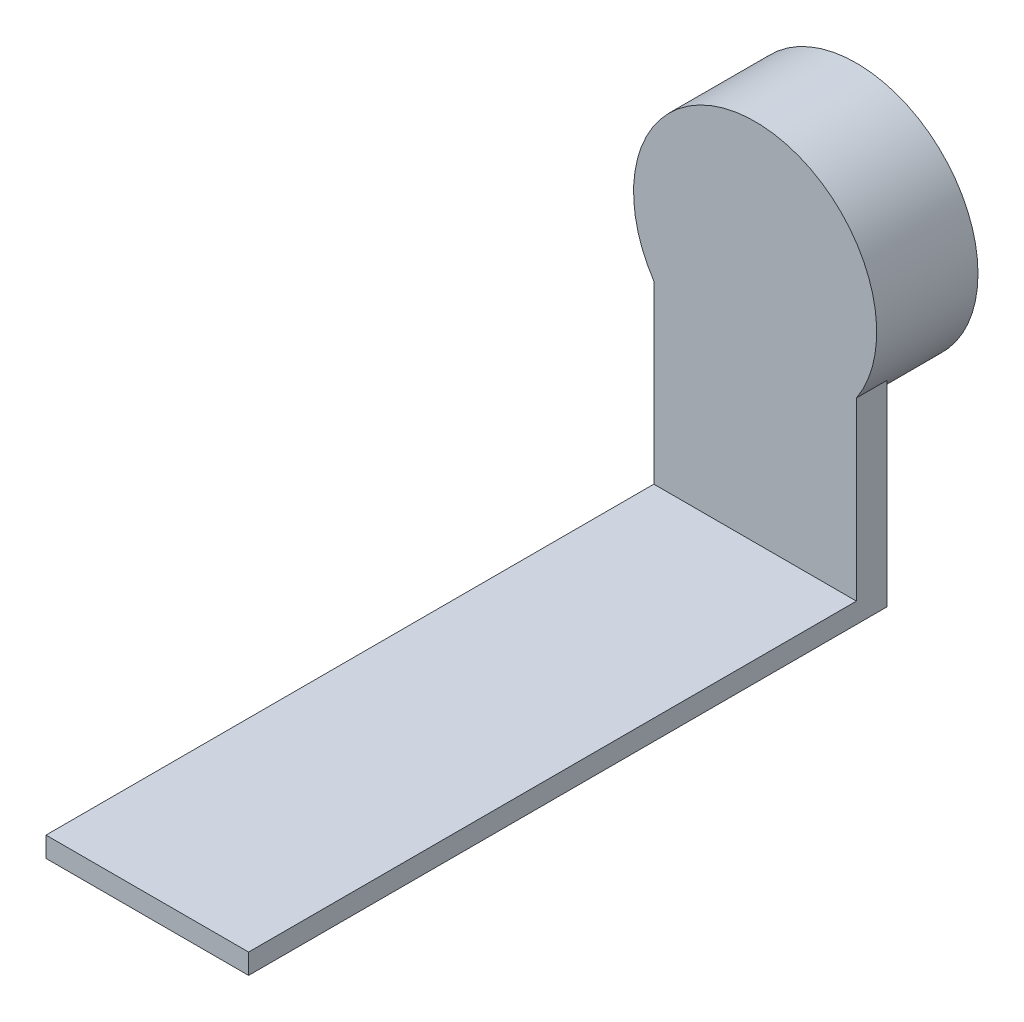
ISO-10303-21;
HEADER;
FILE_DESCRIPTION(('STEP AP214'),'2;1');
FILE_NAME('part.step','',(''),(''),'','','');
FILE_SCHEMA(('AUTOMOTIVE_DESIGN { 1 0 10303 214 1 1 1 1 }'));
ENDSEC;
DATA;
#1=APPLICATION_CONTEXT('core data for automotive mechanical design processes');
#2=APPLICATION_PROTOCOL_DEFINITION('international standard','automotive_design',2000,#1);
#3=PRODUCT_CONTEXT('',#1,'mechanical');
#4=PRODUCT('Part','Part','',(#3));
#5=PRODUCT_RELATED_PRODUCT_CATEGORY('part','',(#4));
#6=PRODUCT_DEFINITION_FORMATION('','',#4);
#7=PRODUCT_DEFINITION_CONTEXT('part definition',#1,'design');
#8=PRODUCT_DEFINITION('design','',#6,#7);
#9=PRODUCT_DEFINITION_SHAPE('','',#8);
#10=(LENGTH_UNIT() NAMED_UNIT(*) SI_UNIT(.MILLI.,.METRE.));
#11=(NAMED_UNIT(*) PLANE_ANGLE_UNIT() SI_UNIT($,.RADIAN.));
#12=(NAMED_UNIT(*) SI_UNIT($,.STERADIAN.) SOLID_ANGLE_UNIT());
#13=UNCERTAINTY_MEASURE_WITH_UNIT(LENGTH_MEASURE(1.E-05),#10,'distance_accuracy_value','');
#14=(GEOMETRIC_REPRESENTATION_CONTEXT(3) GLOBAL_UNCERTAINTY_ASSIGNED_CONTEXT((#13)) GLOBAL_UNIT_ASSIGNED_CONTEXT((#10,
#11,#12)) REPRESENTATION_CONTEXT('',''));
#15=CARTESIAN_POINT('',(0.,0.,0.));
#16=DIRECTION('',(0.,0.,1.));
#17=DIRECTION('',(1.,0.,0.));
#18=AXIS2_PLACEMENT_3D('',#15,#16,#17);
#19=CARTESIAN_POINT('',(0.,0.,10.));
#20=DIRECTION('',(0.,0.,-1.));
#21=DIRECTION('',(-1.,0.,0.));
#22=AXIS2_PLACEMENT_3D('',#19,#20,#21);
#23=CYLINDRICAL_SURFACE('',#22,12.);
#24=CARTESIAN_POINT('',(0.,0.,7.));
#25=DIRECTION('',(0.,0.,-1.));
#26=DIRECTION('',(1.,0.,0.));
#27=AXIS2_PLACEMENT_3D('',#24,#25,#26);
#28=CIRCLE('',#27,12.);
#29=CARTESIAN_POINT('',(10.,-6.6332495807108,7.));
#30=VERTEX_POINT('',#29);
#31=CARTESIAN_POINT('',(-10.,-6.6332495807108,7.));
#32=VERTEX_POINT('',#31);
#33=EDGE_CURVE('E136',#30,#32,#28,.T.);
#34=ORIENTED_EDGE('',*,*,#33,.T.);
#35=DIRECTION('',(0.,0.,1.));
#36=VECTOR('',#35,1.);
#37=CARTESIAN_POINT('',(-10.,-6.6332495807108,7.));
#38=LINE('',#37,#36);
#39=CARTESIAN_POINT('',(-10.,-6.6332495807108,10.));
#40=VERTEX_POINT('',#39);
#41=EDGE_CURVE('E102',#32,#40,#38,.T.);
#42=ORIENTED_EDGE('',*,*,#41,.T.);
#43=CARTESIAN_POINT('',(0.,0.,10.));
#44=DIRECTION('',(0.,0.,1.));
#45=DIRECTION('',(1.,0.,0.));
#46=AXIS2_PLACEMENT_3D('',#43,#44,#45);
#47=CIRCLE('',#46,12.);
#48=CARTESIAN_POINT('',(10.,-6.6332495807108,10.));
#49=VERTEX_POINT('',#48);
#50=EDGE_CURVE('E11',#49,#40,#47,.T.);
#51=ORIENTED_EDGE('',*,*,#50,.F.);
#52=DIRECTION('',(0.,0.,1.));
#53=VECTOR('',#52,1.);
#54=CARTESIAN_POINT('',(10.,-6.6332495807108,7.));
#55=LINE('',#54,#53);
#56=EDGE_CURVE('E144',#30,#49,#55,.T.);
#57=ORIENTED_EDGE('',*,*,#56,.F.);
#58=EDGE_LOOP('',(#34,#42,#51,#57));
#59=FACE_BOUND('',#58,.T.);
#60=CARTESIAN_POINT('',(0.,0.,0.));
#61=DIRECTION('',(0.,0.,1.));
#62=DIRECTION('',(1.,0.,0.));
#63=AXIS2_PLACEMENT_3D('',#60,#61,#62);
#64=CIRCLE('',#63,12.);
#65=CARTESIAN_POINT('',(12.,0.,0.));
#66=VERTEX_POINT('',#65);
#67=EDGE_CURVE('E44',#66,#66,#64,.T.);
#68=ORIENTED_EDGE('',*,*,#67,.T.);
#69=EDGE_LOOP('',(#68));
#70=FACE_BOUND('',#69,.T.);
#71=ADVANCED_FACE('F41',(#59,#70),#23,.T.);
#72=CARTESIAN_POINT('',(0.,0.,10.));
#73=DIRECTION('',(0.,0.,1.));
#74=DIRECTION('',(1.,0.,0.));
#75=AXIS2_PLACEMENT_3D('',#72,#73,#74);
#76=PLANE('',#75);
#77=DIRECTION('',(-1.,0.,0.));
#78=VECTOR('',#77,1.);
#79=CARTESIAN_POINT('',(-10.,-24.,10.));
#80=LINE('',#79,#78);
#81=CARTESIAN_POINT('',(10.,-24.,10.));
#82=VERTEX_POINT('',#81);
#83=CARTESIAN_POINT('',(-10.,-24.,10.));
#84=VERTEX_POINT('',#83);
#85=EDGE_CURVE('E55',#82,#84,#80,.T.);
#86=ORIENTED_EDGE('',*,*,#85,.F.);
#87=DIRECTION('',(0.,1.,0.));
#88=VECTOR('',#87,1.);
#89=CARTESIAN_POINT('',(10.,-26.,10.));
#90=LINE('',#89,#88);
#91=EDGE_CURVE('E58',#82,#49,#90,.T.);
#92=ORIENTED_EDGE('',*,*,#91,.T.);
#93=ORIENTED_EDGE('',*,*,#50,.T.);
#94=DIRECTION('',(0.,-1.,0.));
#95=VECTOR('',#94,1.);
#96=CARTESIAN_POINT('',(-10.,-26.,10.));
#97=LINE('',#96,#95);
#98=EDGE_CURVE('E133',#40,#84,#97,.T.);
#99=ORIENTED_EDGE('',*,*,#98,.T.);
#100=EDGE_LOOP('',(#86,#92,#93,#99));
#101=FACE_BOUND('',#100,.T.);
#102=ADVANCED_FACE('F154',(#101),#76,.T.);
#103=CARTESIAN_POINT('',(0.,0.,0.));
#104=DIRECTION('',(0.,0.,1.));
#105=DIRECTION('',(1.,0.,0.));
#106=AXIS2_PLACEMENT_3D('',#103,#104,#105);
#107=PLANE('',#106);
#108=CARTESIAN_POINT('',(0.,0.,0.));
#109=DIRECTION('',(0.,0.,-1.));
#110=DIRECTION('',(-1.,0.,0.));
#111=AXIS2_PLACEMENT_3D('',#108,#109,#110);
#112=CIRCLE('',#111,10.);
#113=CARTESIAN_POINT('',(-10.,0.,0.));
#114=VERTEX_POINT('',#113);
#115=EDGE_CURVE('E120',#114,#114,#112,.T.);
#116=ORIENTED_EDGE('',*,*,#115,.F.);
#117=EDGE_LOOP('',(#116));
#118=FACE_BOUND('',#117,.T.);
#119=ORIENTED_EDGE('',*,*,#67,.F.);
#120=EDGE_LOOP('',(#119));
#121=FACE_BOUND('',#120,.T.);
#122=ADVANCED_FACE('F172',(#118,#121),#107,.F.);
#123=CARTESIAN_POINT('',(10.,-26.,7.));
#124=DIRECTION('',(0.,-1.,0.));
#125=DIRECTION('',(1.,0.,0.));
#126=AXIS2_PLACEMENT_3D('',#123,#124,#125);
#127=PLANE('',#126);
#128=DIRECTION('',(0.,0.,1.));
#129=VECTOR('',#128,1.);
#130=CARTESIAN_POINT('',(10.,-26.,7.));
#131=LINE('',#130,#129);
#132=CARTESIAN_POINT('',(10.,-26.,7.));
#133=VERTEX_POINT('',#132);
#134=CARTESIAN_POINT('',(10.,-26.,70.));
#135=VERTEX_POINT('',#134);
#136=EDGE_CURVE('E107',#133,#135,#131,.T.);
#137=ORIENTED_EDGE('',*,*,#136,.T.);
#138=DIRECTION('',(1.,0.,0.));
#139=VECTOR('',#138,1.);
#140=CARTESIAN_POINT('',(-10.,-26.,70.));
#141=LINE('',#140,#139);
#142=CARTESIAN_POINT('',(-10.,-26.,70.));
#143=VERTEX_POINT('',#142);
#144=EDGE_CURVE('E105',#143,#135,#141,.T.);
#145=ORIENTED_EDGE('',*,*,#144,.F.);
#146=DIRECTION('',(0.,0.,1.));
#147=VECTOR('',#146,1.);
#148=CARTESIAN_POINT('',(-10.,-26.,7.));
#149=LINE('',#148,#147);
#150=CARTESIAN_POINT('',(-10.,-26.,7.));
#151=VERTEX_POINT('',#150);
#152=EDGE_CURVE('E91',#151,#143,#149,.T.);
#153=ORIENTED_EDGE('',*,*,#152,.F.);
#154=DIRECTION('',(1.,0.,0.));
#155=VECTOR('',#154,1.);
#156=CARTESIAN_POINT('',(10.,-26.,7.));
#157=LINE('',#156,#155);
#158=EDGE_CURVE('E130',#151,#133,#157,.T.);
#159=ORIENTED_EDGE('',*,*,#158,.T.);
#160=EDGE_LOOP('',(#137,#145,#153,#159));
#161=FACE_BOUND('',#160,.T.);
#162=ADVANCED_FACE('F106',(#161),#127,.T.);
#163=CARTESIAN_POINT('',(-10.,-26.,7.));
#164=DIRECTION('',(-1.,0.,0.));
#165=DIRECTION('',(0.,-1.,0.));
#166=AXIS2_PLACEMENT_3D('',#163,#164,#165);
#167=PLANE('',#166);
#168=ORIENTED_EDGE('',*,*,#98,.F.);
#169=ORIENTED_EDGE('',*,*,#41,.F.);
#170=DIRECTION('',(0.,-1.,0.));
#171=VECTOR('',#170,1.);
#172=CARTESIAN_POINT('',(-10.,-26.,7.));
#173=LINE('',#172,#171);
#174=EDGE_CURVE('E98',#32,#151,#173,.T.);
#175=ORIENTED_EDGE('',*,*,#174,.T.);
#176=ORIENTED_EDGE('',*,*,#152,.T.);
#177=DIRECTION('',(0.,-1.,0.));
#178=VECTOR('',#177,1.);
#179=CARTESIAN_POINT('',(-10.,-26.,70.));
#180=LINE('',#179,#178);
#181=CARTESIAN_POINT('',(-10.,-24.,70.));
#182=VERTEX_POINT('',#181);
#183=EDGE_CURVE('E96',#182,#143,#180,.T.);
#184=ORIENTED_EDGE('',*,*,#183,.F.);
#185=DIRECTION('',(0.,0.,-1.));
#186=VECTOR('',#185,1.);
#187=CARTESIAN_POINT('',(-10.,-24.,70.));
#188=LINE('',#187,#186);
#189=EDGE_CURVE('E124',#182,#84,#188,.T.);
#190=ORIENTED_EDGE('',*,*,#189,.T.);
#191=EDGE_LOOP('',(#168,#169,#175,#176,#184,#190));
#192=FACE_BOUND('',#191,.T.);
#193=ADVANCED_FACE('F93',(#192),#167,.T.);
#194=CARTESIAN_POINT('',(10.,-26.,7.));
#195=DIRECTION('',(1.,0.,0.));
#196=DIRECTION('',(0.,1.,0.));
#197=AXIS2_PLACEMENT_3D('',#194,#195,#196);
#198=PLANE('',#197);
#199=ORIENTED_EDGE('',*,*,#91,.F.);
#200=DIRECTION('',(0.,0.,-1.));
#201=VECTOR('',#200,1.);
#202=CARTESIAN_POINT('',(10.,-24.,70.));
#203=LINE('',#202,#201);
#204=CARTESIAN_POINT('',(10.,-24.,70.));
#205=VERTEX_POINT('',#204);
#206=EDGE_CURVE('E127',#205,#82,#203,.T.);
#207=ORIENTED_EDGE('',*,*,#206,.F.);
#208=DIRECTION('',(0.,1.,0.));
#209=VECTOR('',#208,1.);
#210=CARTESIAN_POINT('',(10.,-26.,70.));
#211=LINE('',#210,#209);
#212=EDGE_CURVE('E110',#135,#205,#211,.T.);
#213=ORIENTED_EDGE('',*,*,#212,.F.);
#214=ORIENTED_EDGE('',*,*,#136,.F.);
#215=DIRECTION('',(0.,1.,0.));
#216=VECTOR('',#215,1.);
#217=CARTESIAN_POINT('',(10.,-26.,7.));
#218=LINE('',#217,#216);
#219=EDGE_CURVE('E132',#133,#30,#218,.T.);
#220=ORIENTED_EDGE('',*,*,#219,.T.);
#221=ORIENTED_EDGE('',*,*,#56,.T.);
#222=EDGE_LOOP('',(#199,#207,#213,#214,#220,#221));
#223=FACE_BOUND('',#222,.T.);
#224=ADVANCED_FACE('F149',(#223),#198,.T.);
#225=CARTESIAN_POINT('',(0.,0.,7.));
#226=DIRECTION('',(0.,0.,1.));
#227=DIRECTION('',(1.,0.,0.));
#228=AXIS2_PLACEMENT_3D('',#225,#226,#227);
#229=PLANE('',#228);
#230=ORIENTED_EDGE('',*,*,#158,.F.);
#231=ORIENTED_EDGE('',*,*,#174,.F.);
#232=ORIENTED_EDGE('',*,*,#33,.F.);
#233=ORIENTED_EDGE('',*,*,#219,.F.);
#234=EDGE_LOOP('',(#230,#231,#232,#233));
#235=FACE_BOUND('',#234,.T.);
#236=ADVANCED_FACE('F158',(#235),#229,.F.);
#237=CARTESIAN_POINT('',(-10.,-24.,70.));
#238=DIRECTION('',(0.,-1.,0.));
#239=DIRECTION('',(0.,0.,-1.));
#240=AXIS2_PLACEMENT_3D('',#237,#238,#239);
#241=PLANE('',#240);
#242=ORIENTED_EDGE('',*,*,#85,.T.);
#243=ORIENTED_EDGE('',*,*,#189,.F.);
#244=DIRECTION('',(-1.,0.,0.));
#245=VECTOR('',#244,1.);
#246=CARTESIAN_POINT('',(-10.,-24.,70.));
#247=LINE('',#246,#245);
#248=EDGE_CURVE('E114',#205,#182,#247,.T.);
#249=ORIENTED_EDGE('',*,*,#248,.F.);
#250=ORIENTED_EDGE('',*,*,#206,.T.);
#251=EDGE_LOOP('',(#242,#243,#249,#250));
#252=FACE_BOUND('',#251,.T.);
#253=ADVANCED_FACE('F156',(#252),#241,.F.);
#254=CARTESIAN_POINT('',(0.,0.,70.));
#255=DIRECTION('',(0.,0.,-1.));
#256=DIRECTION('',(-1.,0.,0.));
#257=AXIS2_PLACEMENT_3D('',#254,#255,#256);
#258=PLANE('',#257);
#259=ORIENTED_EDGE('',*,*,#183,.T.);
#260=ORIENTED_EDGE('',*,*,#144,.T.);
#261=ORIENTED_EDGE('',*,*,#212,.T.);
#262=ORIENTED_EDGE('',*,*,#248,.T.);
#263=EDGE_LOOP('',(#259,#260,#261,#262));
#264=FACE_BOUND('',#263,.T.);
#265=ADVANCED_FACE('F112',(#264),#258,.F.);
#266=CARTESIAN_POINT('',(0.,0.,8.));
#267=DIRECTION('',(0.,0.,-1.));
#268=DIRECTION('',(-1.,0.,0.));
#269=AXIS2_PLACEMENT_3D('',#266,#267,#268);
#270=CYLINDRICAL_SURFACE('',#269,10.);
#271=CARTESIAN_POINT('',(0.,0.,8.));
#272=DIRECTION('',(0.,0.,-1.));
#273=DIRECTION('',(-1.,0.,0.));
#274=AXIS2_PLACEMENT_3D('',#271,#272,#273);
#275=CIRCLE('',#274,10.);
#276=CARTESIAN_POINT('',(-10.,0.,8.));
#277=VERTEX_POINT('',#276);
#278=EDGE_CURVE('E117',#277,#277,#275,.T.);
#279=ORIENTED_EDGE('',*,*,#278,.F.);
#280=EDGE_LOOP('',(#279));
#281=FACE_BOUND('',#280,.T.);
#282=ORIENTED_EDGE('',*,*,#115,.T.);
#283=EDGE_LOOP('',(#282));
#284=FACE_BOUND('',#283,.T.);
#285=ADVANCED_FACE('F205',(#281,#284),#270,.F.);
#286=CARTESIAN_POINT('',(0.,0.,8.));
#287=DIRECTION('',(0.,0.,-1.));
#288=DIRECTION('',(-1.,0.,0.));
#289=AXIS2_PLACEMENT_3D('',#286,#287,#288);
#290=PLANE('',#289);
#291=ORIENTED_EDGE('',*,*,#278,.T.);
#292=EDGE_LOOP('',(#291));
#293=FACE_BOUND('',#292,.T.);
#294=ADVANCED_FACE('F222',(#293),#290,.T.);
#295=CLOSED_SHELL('',(#71,#102,#122,#162,#193,#224,#236,#253,#265,#285,#294));
#296=MANIFOLD_SOLID_BREP('B2',#295);
#297=ADVANCED_BREP_SHAPE_REPRESENTATION('',(#18,#296),#14);
#298=SHAPE_DEFINITION_REPRESENTATION(#9,#297);
ENDSEC;
END-ISO-10303-21;
